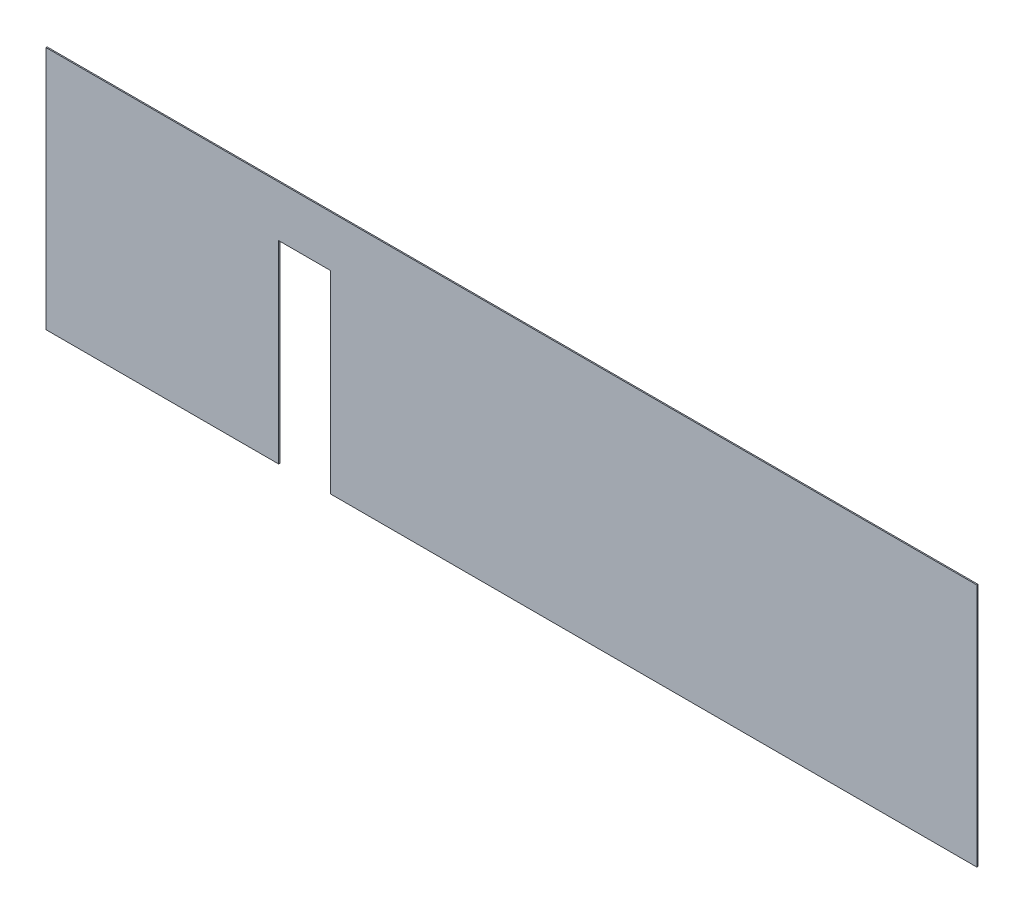
ISO-10303-21;
HEADER;
FILE_DESCRIPTION(('STEP AP214'),'2;1');
FILE_NAME('part.step','',(''),(''),'','','');
FILE_SCHEMA(('AUTOMOTIVE_DESIGN { 1 0 10303 214 1 1 1 1 }'));
ENDSEC;
DATA;
#1=APPLICATION_CONTEXT('core data for automotive mechanical design processes');
#2=APPLICATION_PROTOCOL_DEFINITION('international standard','automotive_design',2000,#1);
#3=PRODUCT_CONTEXT('',#1,'mechanical');
#4=PRODUCT('Part','Part','',(#3));
#5=PRODUCT_RELATED_PRODUCT_CATEGORY('part','',(#4));
#6=PRODUCT_DEFINITION_FORMATION('','',#4);
#7=PRODUCT_DEFINITION_CONTEXT('part definition',#1,'design');
#8=PRODUCT_DEFINITION('design','',#6,#7);
#9=PRODUCT_DEFINITION_SHAPE('','',#8);
#10=(LENGTH_UNIT() NAMED_UNIT(*) SI_UNIT(.MILLI.,.METRE.));
#11=(NAMED_UNIT(*) PLANE_ANGLE_UNIT() SI_UNIT($,.RADIAN.));
#12=(NAMED_UNIT(*) SI_UNIT($,.STERADIAN.) SOLID_ANGLE_UNIT());
#13=UNCERTAINTY_MEASURE_WITH_UNIT(LENGTH_MEASURE(1.E-05),#10,'distance_accuracy_value','');
#14=(GEOMETRIC_REPRESENTATION_CONTEXT(3) GLOBAL_UNCERTAINTY_ASSIGNED_CONTEXT((#13)) GLOBAL_UNIT_ASSIGNED_CONTEXT((#10,
#11,#12)) REPRESENTATION_CONTEXT('',''));
#15=CARTESIAN_POINT('',(0.,0.,0.));
#16=DIRECTION('',(0.,0.,1.));
#17=DIRECTION('',(1.,0.,0.));
#18=AXIS2_PLACEMENT_3D('',#15,#16,#17);
#19=CARTESIAN_POINT('',(-4000.,-1050.,10.));
#20=DIRECTION('',(0.,1.,0.));
#21=DIRECTION('',(0.,0.,1.));
#22=AXIS2_PLACEMENT_3D('',#19,#20,#21);
#23=PLANE('',#22);
#24=DIRECTION('',(1.,0.,0.));
#25=VECTOR('',#24,1.);
#26=CARTESIAN_POINT('',(-4000.,-1050.,0.));
#27=LINE('',#26,#25);
#28=CARTESIAN_POINT('',(-4000.,-1050.,0.));
#29=VERTEX_POINT('',#28);
#30=CARTESIAN_POINT('',(-2000.,-1050.,0.));
#31=VERTEX_POINT('',#30);
#32=EDGE_CURVE('E124',#29,#31,#27,.T.);
#33=ORIENTED_EDGE('',*,*,#32,.T.);
#34=DIRECTION('',(0.,0.,1.));
#35=VECTOR('',#34,1.);
#36=CARTESIAN_POINT('',(-2000.,-1050.,0.));
#37=LINE('',#36,#35);
#38=CARTESIAN_POINT('',(-2000.,-1050.,10.));
#39=VERTEX_POINT('',#38);
#40=EDGE_CURVE('E108',#31,#39,#37,.T.);
#41=ORIENTED_EDGE('',*,*,#40,.T.);
#42=DIRECTION('',(1.,0.,0.));
#43=VECTOR('',#42,1.);
#44=CARTESIAN_POINT('',(-4000.,-1050.,10.));
#45=LINE('',#44,#43);
#46=CARTESIAN_POINT('',(-4000.,-1050.,10.));
#47=VERTEX_POINT('',#46);
#48=EDGE_CURVE('E141',#47,#39,#45,.T.);
#49=ORIENTED_EDGE('',*,*,#48,.F.);
#50=DIRECTION('',(0.,0.,-1.));
#51=VECTOR('',#50,1.);
#52=CARTESIAN_POINT('',(-4000.,-1050.,10.));
#53=LINE('',#52,#51);
#54=EDGE_CURVE('E131',#47,#29,#53,.T.);
#55=ORIENTED_EDGE('',*,*,#54,.T.);
#56=EDGE_LOOP('',(#33,#41,#49,#55));
#57=FACE_BOUND('',#56,.T.);
#58=ADVANCED_FACE('F33',(#57),#23,.F.);
#59=CARTESIAN_POINT('',(4000.,1050.,10.));
#60=DIRECTION('',(-1.,0.,0.));
#61=DIRECTION('',(0.,0.,1.));
#62=AXIS2_PLACEMENT_3D('',#59,#60,#61);
#63=PLANE('',#62);
#64=DIRECTION('',(0.,1.,0.));
#65=VECTOR('',#64,1.);
#66=CARTESIAN_POINT('',(4000.,1050.,0.));
#67=LINE('',#66,#65);
#68=CARTESIAN_POINT('',(4000.,-1050.,0.));
#69=VERTEX_POINT('',#68);
#70=CARTESIAN_POINT('',(4000.,1050.,0.));
#71=VERTEX_POINT('',#70);
#72=EDGE_CURVE('E149',#69,#71,#67,.T.);
#73=ORIENTED_EDGE('',*,*,#72,.T.);
#74=DIRECTION('',(0.,0.,-1.));
#75=VECTOR('',#74,1.);
#76=CARTESIAN_POINT('',(4000.,1050.,10.));
#77=LINE('',#76,#75);
#78=CARTESIAN_POINT('',(4000.,1050.,10.));
#79=VERTEX_POINT('',#78);
#80=EDGE_CURVE('E11',#79,#71,#77,.T.);
#81=ORIENTED_EDGE('',*,*,#80,.F.);
#82=DIRECTION('',(0.,1.,0.));
#83=VECTOR('',#82,1.);
#84=CARTESIAN_POINT('',(4000.,1050.,10.));
#85=LINE('',#84,#83);
#86=CARTESIAN_POINT('',(4000.,-1050.,10.));
#87=VERTEX_POINT('',#86);
#88=EDGE_CURVE('E132',#87,#79,#85,.T.);
#89=ORIENTED_EDGE('',*,*,#88,.F.);
#90=DIRECTION('',(0.,0.,-1.));
#91=VECTOR('',#90,1.);
#92=CARTESIAN_POINT('',(4000.,-1050.,10.));
#93=LINE('',#92,#91);
#94=EDGE_CURVE('E139',#87,#69,#93,.T.);
#95=ORIENTED_EDGE('',*,*,#94,.T.);
#96=EDGE_LOOP('',(#73,#81,#89,#95));
#97=FACE_BOUND('',#96,.T.);
#98=ADVANCED_FACE('F35',(#97),#63,.F.);
#99=CARTESIAN_POINT('',(-4000.,1050.,10.));
#100=DIRECTION('',(0.,-1.,0.));
#101=DIRECTION('',(0.,0.,-1.));
#102=AXIS2_PLACEMENT_3D('',#99,#100,#101);
#103=PLANE('',#102);
#104=DIRECTION('',(-1.,0.,0.));
#105=VECTOR('',#104,1.);
#106=CARTESIAN_POINT('',(-4000.,1050.,0.));
#107=LINE('',#106,#105);
#108=CARTESIAN_POINT('',(-4000.,1050.,0.));
#109=VERTEX_POINT('',#108);
#110=EDGE_CURVE('E148',#71,#109,#107,.T.);
#111=ORIENTED_EDGE('',*,*,#110,.T.);
#112=DIRECTION('',(0.,0.,-1.));
#113=VECTOR('',#112,1.);
#114=CARTESIAN_POINT('',(-4000.,1050.,10.));
#115=LINE('',#114,#113);
#116=CARTESIAN_POINT('',(-4000.,1050.,10.));
#117=VERTEX_POINT('',#116);
#118=EDGE_CURVE('E41',#117,#109,#115,.T.);
#119=ORIENTED_EDGE('',*,*,#118,.F.);
#120=DIRECTION('',(-1.,0.,0.));
#121=VECTOR('',#120,1.);
#122=CARTESIAN_POINT('',(-4000.,1050.,10.));
#123=LINE('',#122,#121);
#124=EDGE_CURVE('E86',#79,#117,#123,.T.);
#125=ORIENTED_EDGE('',*,*,#124,.F.);
#126=ORIENTED_EDGE('',*,*,#80,.T.);
#127=EDGE_LOOP('',(#111,#119,#125,#126));
#128=FACE_BOUND('',#127,.T.);
#129=ADVANCED_FACE('F192',(#128),#103,.F.);
#130=CARTESIAN_POINT('',(-4000.,1050.,10.));
#131=DIRECTION('',(1.,0.,0.));
#132=DIRECTION('',(0.,0.,-1.));
#133=AXIS2_PLACEMENT_3D('',#130,#131,#132);
#134=PLANE('',#133);
#135=DIRECTION('',(0.,-1.,0.));
#136=VECTOR('',#135,1.);
#137=CARTESIAN_POINT('',(-4000.,1050.,0.));
#138=LINE('',#137,#136);
#139=EDGE_CURVE('E135',#109,#29,#138,.T.);
#140=ORIENTED_EDGE('',*,*,#139,.T.);
#141=ORIENTED_EDGE('',*,*,#54,.F.);
#142=DIRECTION('',(0.,-1.,0.));
#143=VECTOR('',#142,1.);
#144=CARTESIAN_POINT('',(-4000.,1050.,10.));
#145=LINE('',#144,#143);
#146=EDGE_CURVE('E146',#117,#47,#145,.T.);
#147=ORIENTED_EDGE('',*,*,#146,.F.);
#148=ORIENTED_EDGE('',*,*,#118,.T.);
#149=EDGE_LOOP('',(#140,#141,#147,#148));
#150=FACE_BOUND('',#149,.T.);
#151=ADVANCED_FACE('F145',(#150),#134,.F.);
#152=CARTESIAN_POINT('',(-1553.,-1050.,10.));
#153=VERTEX_POINT('',#152);
#154=EDGE_CURVE('E57',#153,#87,#45,.T.);
#155=ORIENTED_EDGE('',*,*,#154,.F.);
#156=DIRECTION('',(0.,0.,1.));
#157=VECTOR('',#156,1.);
#158=CARTESIAN_POINT('',(-1553.,-1050.,0.));
#159=LINE('',#158,#157);
#160=CARTESIAN_POINT('',(-1553.,-1050.,0.));
#161=VERTEX_POINT('',#160);
#162=EDGE_CURVE('E118',#161,#153,#159,.T.);
#163=ORIENTED_EDGE('',*,*,#162,.F.);
#164=EDGE_CURVE('E79',#161,#69,#27,.T.);
#165=ORIENTED_EDGE('',*,*,#164,.T.);
#166=ORIENTED_EDGE('',*,*,#94,.F.);
#167=EDGE_LOOP('',(#155,#163,#165,#166));
#168=FACE_BOUND('',#167,.T.);
#169=ADVANCED_FACE('F170',(#168),#23,.F.);
#170=CARTESIAN_POINT('',(0.,0.,10.));
#171=DIRECTION('',(0.,0.,1.));
#172=DIRECTION('',(1.,0.,0.));
#173=AXIS2_PLACEMENT_3D('',#170,#171,#172);
#174=PLANE('',#173);
#175=DIRECTION('',(0.,-1.,0.));
#176=VECTOR('',#175,1.);
#177=CARTESIAN_POINT('',(-2000.,-1050.,10.));
#178=LINE('',#177,#176);
#179=CARTESIAN_POINT('',(-2000.,613.,10.));
#180=VERTEX_POINT('',#179);
#181=EDGE_CURVE('E113',#180,#39,#178,.T.);
#182=ORIENTED_EDGE('',*,*,#181,.F.);
#183=DIRECTION('',(-1.,0.,0.));
#184=VECTOR('',#183,1.);
#185=CARTESIAN_POINT('',(-2000.,613.,10.));
#186=LINE('',#185,#184);
#187=CARTESIAN_POINT('',(-1553.,613.,10.));
#188=VERTEX_POINT('',#187);
#189=EDGE_CURVE('E127',#188,#180,#186,.T.);
#190=ORIENTED_EDGE('',*,*,#189,.F.);
#191=DIRECTION('',(0.,1.,0.));
#192=VECTOR('',#191,1.);
#193=CARTESIAN_POINT('',(-1553.,-1050.,10.));
#194=LINE('',#193,#192);
#195=EDGE_CURVE('E163',#153,#188,#194,.T.);
#196=ORIENTED_EDGE('',*,*,#195,.F.);
#197=ORIENTED_EDGE('',*,*,#154,.T.);
#198=ORIENTED_EDGE('',*,*,#88,.T.);
#199=ORIENTED_EDGE('',*,*,#124,.T.);
#200=ORIENTED_EDGE('',*,*,#146,.T.);
#201=ORIENTED_EDGE('',*,*,#48,.T.);
#202=EDGE_LOOP('',(#182,#190,#196,#197,#198,#199,#200,#201));
#203=FACE_BOUND('',#202,.T.);
#204=ADVANCED_FACE('F174',(#203),#174,.T.);
#205=CARTESIAN_POINT('',(0.,0.,0.));
#206=DIRECTION('',(0.,0.,1.));
#207=DIRECTION('',(1.,0.,0.));
#208=AXIS2_PLACEMENT_3D('',#205,#206,#207);
#209=PLANE('',#208);
#210=DIRECTION('',(-1.,0.,0.));
#211=VECTOR('',#210,1.);
#212=CARTESIAN_POINT('',(-2000.,613.,0.));
#213=LINE('',#212,#211);
#214=CARTESIAN_POINT('',(-1553.,613.,0.));
#215=VERTEX_POINT('',#214);
#216=CARTESIAN_POINT('',(-2000.,613.,0.));
#217=VERTEX_POINT('',#216);
#218=EDGE_CURVE('E48',#215,#217,#213,.T.);
#219=ORIENTED_EDGE('',*,*,#218,.T.);
#220=DIRECTION('',(0.,-1.,0.));
#221=VECTOR('',#220,1.);
#222=CARTESIAN_POINT('',(-2000.,-1050.,0.));
#223=LINE('',#222,#221);
#224=EDGE_CURVE('E111',#217,#31,#223,.T.);
#225=ORIENTED_EDGE('',*,*,#224,.T.);
#226=ORIENTED_EDGE('',*,*,#32,.F.);
#227=ORIENTED_EDGE('',*,*,#139,.F.);
#228=ORIENTED_EDGE('',*,*,#110,.F.);
#229=ORIENTED_EDGE('',*,*,#72,.F.);
#230=ORIENTED_EDGE('',*,*,#164,.F.);
#231=DIRECTION('',(0.,1.,0.));
#232=VECTOR('',#231,1.);
#233=CARTESIAN_POINT('',(-1553.,-1050.,0.));
#234=LINE('',#233,#232);
#235=EDGE_CURVE('E126',#161,#215,#234,.T.);
#236=ORIENTED_EDGE('',*,*,#235,.T.);
#237=EDGE_LOOP('',(#219,#225,#226,#227,#228,#229,#230,#236));
#238=FACE_BOUND('',#237,.T.);
#239=ADVANCED_FACE('F122',(#238),#209,.F.);
#240=CARTESIAN_POINT('',(-2000.,-1050.,0.));
#241=DIRECTION('',(-1.,0.,0.));
#242=DIRECTION('',(0.,0.,1.));
#243=AXIS2_PLACEMENT_3D('',#240,#241,#242);
#244=PLANE('',#243);
#245=ORIENTED_EDGE('',*,*,#181,.T.);
#246=ORIENTED_EDGE('',*,*,#40,.F.);
#247=ORIENTED_EDGE('',*,*,#224,.F.);
#248=DIRECTION('',(0.,0.,1.));
#249=VECTOR('',#248,1.);
#250=CARTESIAN_POINT('',(-2000.,613.,0.));
#251=LINE('',#250,#249);
#252=EDGE_CURVE('E151',#217,#180,#251,.T.);
#253=ORIENTED_EDGE('',*,*,#252,.T.);
#254=EDGE_LOOP('',(#245,#246,#247,#253));
#255=FACE_BOUND('',#254,.T.);
#256=ADVANCED_FACE('F110',(#255),#244,.F.);
#257=CARTESIAN_POINT('',(-2000.,613.,0.));
#258=DIRECTION('',(0.,1.,0.));
#259=DIRECTION('',(0.,0.,1.));
#260=AXIS2_PLACEMENT_3D('',#257,#258,#259);
#261=PLANE('',#260);
#262=ORIENTED_EDGE('',*,*,#189,.T.);
#263=ORIENTED_EDGE('',*,*,#252,.F.);
#264=ORIENTED_EDGE('',*,*,#218,.F.);
#265=DIRECTION('',(0.,0.,1.));
#266=VECTOR('',#265,1.);
#267=CARTESIAN_POINT('',(-1553.,613.,0.));
#268=LINE('',#267,#266);
#269=EDGE_CURVE('E158',#215,#188,#268,.T.);
#270=ORIENTED_EDGE('',*,*,#269,.T.);
#271=EDGE_LOOP('',(#262,#263,#264,#270));
#272=FACE_BOUND('',#271,.T.);
#273=ADVANCED_FACE('F176',(#272),#261,.F.);
#274=CARTESIAN_POINT('',(-1553.,-1050.,0.));
#275=DIRECTION('',(1.,0.,0.));
#276=DIRECTION('',(0.,0.,-1.));
#277=AXIS2_PLACEMENT_3D('',#274,#275,#276);
#278=PLANE('',#277);
#279=ORIENTED_EDGE('',*,*,#195,.T.);
#280=ORIENTED_EDGE('',*,*,#269,.F.);
#281=ORIENTED_EDGE('',*,*,#235,.F.);
#282=ORIENTED_EDGE('',*,*,#162,.T.);
#283=EDGE_LOOP('',(#279,#280,#281,#282));
#284=FACE_BOUND('',#283,.T.);
#285=ADVANCED_FACE('F169',(#284),#278,.F.);
#286=CLOSED_SHELL('',(#58,#98,#129,#151,#169,#204,#239,#256,#273,#285));
#287=MANIFOLD_SOLID_BREP('B2',#286);
#288=ADVANCED_BREP_SHAPE_REPRESENTATION('',(#18,#287),#14);
#289=SHAPE_DEFINITION_REPRESENTATION(#9,#288);
ENDSEC;
END-ISO-10303-21;
